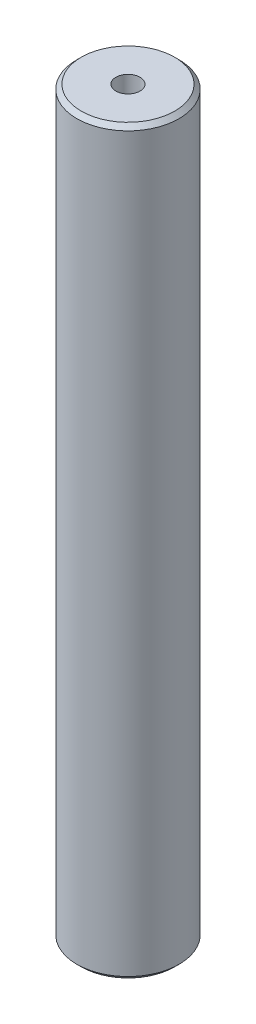
ISO-10303-21;
HEADER;
FILE_DESCRIPTION(('STEP AP214'),'2;1');
FILE_NAME('part.step','',(''),(''),'','','');
FILE_SCHEMA(('AUTOMOTIVE_DESIGN { 1 0 10303 214 1 1 1 1 }'));
ENDSEC;
DATA;
#1=APPLICATION_CONTEXT('core data for automotive mechanical design processes');
#2=APPLICATION_PROTOCOL_DEFINITION('international standard','automotive_design',2000,#1);
#3=PRODUCT_CONTEXT('',#1,'mechanical');
#4=PRODUCT('Part','Part','',(#3));
#5=PRODUCT_RELATED_PRODUCT_CATEGORY('part','',(#4));
#6=PRODUCT_DEFINITION_FORMATION('','',#4);
#7=PRODUCT_DEFINITION_CONTEXT('part definition',#1,'design');
#8=PRODUCT_DEFINITION('design','',#6,#7);
#9=PRODUCT_DEFINITION_SHAPE('','',#8);
#10=(LENGTH_UNIT() NAMED_UNIT(*) SI_UNIT(.MILLI.,.METRE.));
#11=(NAMED_UNIT(*) PLANE_ANGLE_UNIT() SI_UNIT($,.RADIAN.));
#12=(NAMED_UNIT(*) SI_UNIT($,.STERADIAN.) SOLID_ANGLE_UNIT());
#13=UNCERTAINTY_MEASURE_WITH_UNIT(LENGTH_MEASURE(1.E-05),#10,'distance_accuracy_value','');
#14=(GEOMETRIC_REPRESENTATION_CONTEXT(3) GLOBAL_UNCERTAINTY_ASSIGNED_CONTEXT((#13)) GLOBAL_UNIT_ASSIGNED_CONTEXT((#10,
#11,#12)) REPRESENTATION_CONTEXT('',''));
#15=CARTESIAN_POINT('',(0.,0.,0.));
#16=DIRECTION('',(0.,0.,1.));
#17=DIRECTION('',(1.,0.,0.));
#18=AXIS2_PLACEMENT_3D('',#15,#16,#17);
#19=CARTESIAN_POINT('',(0.,72.5306756795256,0.));
#20=DIRECTION('',(0.,-1.,0.));
#21=DIRECTION('',(0.,0.,-1.));
#22=AXIS2_PLACEMENT_3D('',#19,#20,#21);
#23=CYLINDRICAL_SURFACE('',#22,5.);
#24=CARTESIAN_POINT('',(0.,72.1045804466313,0.));
#25=DIRECTION('',(0.,1.,0.));
#26=DIRECTION('',(0.,0.,1.));
#27=AXIS2_PLACEMENT_3D('',#24,#25,#26);
#28=CIRCLE('',#27,5.);
#29=CARTESIAN_POINT('',(0.,72.1045804466313,5.));
#30=VERTEX_POINT('',#29);
#31=EDGE_CURVE('E50',#30,#30,#28,.F.);
#32=ORIENTED_EDGE('',*,*,#31,.T.);
#33=EDGE_LOOP('',(#32));
#34=FACE_BOUND('',#33,.T.);
#35=CARTESIAN_POINT('',(0.,0.426095232894247,0.));
#36=DIRECTION('',(0.,1.,0.));
#37=DIRECTION('',(0.,0.,1.));
#38=AXIS2_PLACEMENT_3D('',#35,#36,#37);
#39=CIRCLE('',#38,5.);
#40=CARTESIAN_POINT('',(0.,0.426095232894247,5.));
#41=VERTEX_POINT('',#40);
#42=EDGE_CURVE('E51',#41,#41,#39,.T.);
#43=ORIENTED_EDGE('',*,*,#42,.T.);
#44=EDGE_LOOP('',(#43));
#45=FACE_BOUND('',#44,.T.);
#46=ADVANCED_FACE('F39',(#34,#45),#23,.T.);
#47=CARTESIAN_POINT('',(0.,72.5306756795256,0.));
#48=DIRECTION('',(0.,1.,0.));
#49=DIRECTION('',(0.,0.,1.));
#50=AXIS2_PLACEMENT_3D('',#47,#48,#49);
#51=PLANE('',#50);
#52=CARTESIAN_POINT('',(0.,72.5306756795256,0.));
#53=DIRECTION('',(0.,1.,0.));
#54=DIRECTION('',(0.,0.,1.));
#55=AXIS2_PLACEMENT_3D('',#52,#53,#54);
#56=CIRCLE('',#55,4.57390476710574);
#57=CARTESIAN_POINT('',(0.,72.5306756795256,4.57390476710574));
#58=VERTEX_POINT('',#57);
#59=EDGE_CURVE('E54',#58,#58,#56,.T.);
#60=ORIENTED_EDGE('',*,*,#59,.T.);
#61=EDGE_LOOP('',(#60));
#62=FACE_BOUND('',#61,.T.);
#63=CARTESIAN_POINT('',(0.,72.5306756795256,0.));
#64=DIRECTION('',(0.,1.,0.));
#65=DIRECTION('',(0.,0.,1.));
#66=AXIS2_PLACEMENT_3D('',#63,#64,#65);
#67=CIRCLE('',#66,1.18013472098861);
#68=CARTESIAN_POINT('',(0.,72.5306756795256,1.18013472098861));
#69=VERTEX_POINT('',#68);
#70=EDGE_CURVE('E58',#69,#69,#67,.T.);
#71=ORIENTED_EDGE('',*,*,#70,.F.);
#72=EDGE_LOOP('',(#71));
#73=FACE_BOUND('',#72,.T.);
#74=ADVANCED_FACE('F69',(#62,#73),#51,.T.);
#75=CARTESIAN_POINT('',(0.,0.,0.));
#76=DIRECTION('',(0.,1.,0.));
#77=DIRECTION('',(0.,0.,1.));
#78=AXIS2_PLACEMENT_3D('',#75,#76,#77);
#79=PLANE('',#78);
#80=CARTESIAN_POINT('',(0.,0.,0.));
#81=DIRECTION('',(0.,1.,0.));
#82=DIRECTION('',(0.,0.,1.));
#83=AXIS2_PLACEMENT_3D('',#80,#81,#82);
#84=CIRCLE('',#83,4.57390476710576);
#85=CARTESIAN_POINT('',(0.,0.,4.57390476710576));
#86=VERTEX_POINT('',#85);
#87=EDGE_CURVE('E10',#86,#86,#84,.F.);
#88=ORIENTED_EDGE('',*,*,#87,.T.);
#89=EDGE_LOOP('',(#88));
#90=FACE_BOUND('',#89,.T.);
#91=CARTESIAN_POINT('',(0.,0.,0.));
#92=DIRECTION('',(0.,1.,0.));
#93=DIRECTION('',(0.,0.,1.));
#94=AXIS2_PLACEMENT_3D('',#91,#92,#93);
#95=CIRCLE('',#94,1.18013472098861);
#96=CARTESIAN_POINT('',(0.,0.,1.18013472098861));
#97=VERTEX_POINT('',#96);
#98=EDGE_CURVE('E63',#97,#97,#95,.T.);
#99=ORIENTED_EDGE('',*,*,#98,.T.);
#100=EDGE_LOOP('',(#99));
#101=FACE_BOUND('',#100,.T.);
#102=ADVANCED_FACE('F75',(#90,#101),#79,.F.);
#103=CARTESIAN_POINT('',(0.,72.5306756795256,0.));
#104=DIRECTION('',(0.,-1.,0.));
#105=DIRECTION('',(0.,0.,-1.));
#106=AXIS2_PLACEMENT_3D('',#103,#104,#105);
#107=CYLINDRICAL_SURFACE('',#106,1.18013472098861);
#108=ORIENTED_EDGE('',*,*,#70,.T.);
#109=EDGE_LOOP('',(#108));
#110=FACE_BOUND('',#109,.T.);
#111=ORIENTED_EDGE('',*,*,#98,.F.);
#112=EDGE_LOOP('',(#111));
#113=FACE_BOUND('',#112,.T.);
#114=ADVANCED_FACE('F70',(#110,#113),#107,.F.);
#115=CARTESIAN_POINT('',(0.,72.5306756795256,0.));
#116=DIRECTION('',(0.,-1.,0.));
#117=DIRECTION('',(0.,0.,-1.));
#118=AXIS2_PLACEMENT_3D('',#115,#116,#117);
#119=CONICAL_SURFACE('',#118,4.57390476710574,0.785398163397443);
#120=ORIENTED_EDGE('',*,*,#31,.F.);
#121=EDGE_LOOP('',(#120));
#122=FACE_BOUND('',#121,.T.);
#123=ORIENTED_EDGE('',*,*,#59,.F.);
#124=EDGE_LOOP('',(#123));
#125=FACE_BOUND('',#124,.T.);
#126=ADVANCED_FACE('F81',(#122,#125),#119,.T.);
#127=CARTESIAN_POINT('',(0.,0.426095232894247,0.));
#128=DIRECTION('',(0.,1.,0.));
#129=DIRECTION('',(0.,0.,1.));
#130=AXIS2_PLACEMENT_3D('',#127,#128,#129);
#131=CONICAL_SURFACE('',#130,5.,0.785398163397443);
#132=ORIENTED_EDGE('',*,*,#87,.F.);
#133=EDGE_LOOP('',(#132));
#134=FACE_BOUND('',#133,.T.);
#135=ORIENTED_EDGE('',*,*,#42,.F.);
#136=EDGE_LOOP('',(#135));
#137=FACE_BOUND('',#136,.T.);
#138=ADVANCED_FACE('F45',(#134,#137),#131,.T.);
#139=CLOSED_SHELL('',(#46,#74,#102,#114,#126,#138));
#140=MANIFOLD_SOLID_BREP('B2',#139);
#141=ADVANCED_BREP_SHAPE_REPRESENTATION('',(#18,#140),#14);
#142=SHAPE_DEFINITION_REPRESENTATION(#9,#141);
ENDSEC;
END-ISO-10303-21;
